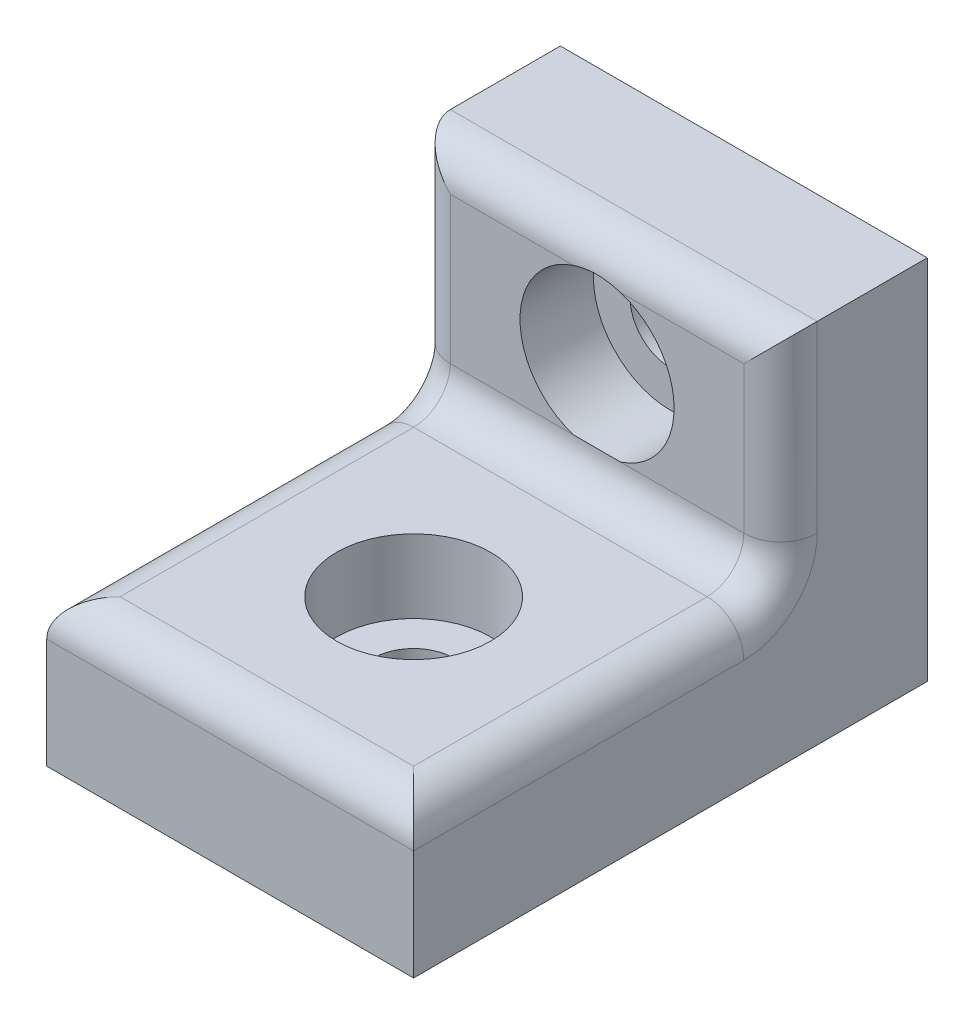
ISO-10303-21;
HEADER;
FILE_DESCRIPTION(('STEP AP214'),'2;1');
FILE_NAME('part.step','',(''),(''),'','','');
FILE_SCHEMA(('AUTOMOTIVE_DESIGN { 1 0 10303 214 1 1 1 1 }'));
ENDSEC;
DATA;
#1=APPLICATION_CONTEXT('core data for automotive mechanical design processes');
#2=APPLICATION_PROTOCOL_DEFINITION('international standard','automotive_design',2000,#1);
#3=PRODUCT_CONTEXT('',#1,'mechanical');
#4=PRODUCT('Part','Part','',(#3));
#5=PRODUCT_RELATED_PRODUCT_CATEGORY('part','',(#4));
#6=PRODUCT_DEFINITION_FORMATION('','',#4);
#7=PRODUCT_DEFINITION_CONTEXT('part definition',#1,'design');
#8=PRODUCT_DEFINITION('design','',#6,#7);
#9=PRODUCT_DEFINITION_SHAPE('','',#8);
#10=(LENGTH_UNIT() NAMED_UNIT(*) SI_UNIT(.MILLI.,.METRE.));
#11=(NAMED_UNIT(*) PLANE_ANGLE_UNIT() SI_UNIT($,.RADIAN.));
#12=(NAMED_UNIT(*) SI_UNIT($,.STERADIAN.) SOLID_ANGLE_UNIT());
#13=UNCERTAINTY_MEASURE_WITH_UNIT(LENGTH_MEASURE(1.E-05),#10,'distance_accuracy_value','');
#14=(GEOMETRIC_REPRESENTATION_CONTEXT(3) GLOBAL_UNCERTAINTY_ASSIGNED_CONTEXT((#13)) GLOBAL_UNIT_ASSIGNED_CONTEXT((#10,
#11,#12)) REPRESENTATION_CONTEXT('',''));
#15=CARTESIAN_POINT('',(0.,0.,0.));
#16=DIRECTION('',(0.,0.,1.));
#17=DIRECTION('',(1.,0.,0.));
#18=AXIS2_PLACEMENT_3D('',#15,#16,#17);
#19=CARTESIAN_POINT('',(0.,0.,9.));
#20=DIRECTION('',(0.,1.,0.));
#21=DIRECTION('',(0.,0.,1.));
#22=AXIS2_PLACEMENT_3D('',#19,#20,#21);
#23=CYLINDRICAL_SURFACE('',#22,1.1);
#24=CARTESIAN_POINT('',(0.,0.,9.));
#25=DIRECTION('',(0.,1.,0.));
#26=DIRECTION('',(0.,0.,1.));
#27=AXIS2_PLACEMENT_3D('',#24,#25,#26);
#28=CIRCLE('',#27,1.1);
#29=CARTESIAN_POINT('',(0.,0.,10.1));
#30=VERTEX_POINT('',#29);
#31=EDGE_CURVE('E203',#30,#30,#28,.T.);
#32=ORIENTED_EDGE('',*,*,#31,.F.);
#33=EDGE_LOOP('',(#32));
#34=FACE_BOUND('',#33,.T.);
#35=CARTESIAN_POINT('',(0.,2.,9.));
#36=DIRECTION('',(0.,1.,0.));
#37=DIRECTION('',(0.,0.,1.));
#38=AXIS2_PLACEMENT_3D('',#35,#36,#37);
#39=CIRCLE('',#38,1.1);
#40=CARTESIAN_POINT('',(0.,2.,10.1));
#41=VERTEX_POINT('',#40);
#42=EDGE_CURVE('E43',#41,#41,#39,.F.);
#43=ORIENTED_EDGE('',*,*,#42,.F.);
#44=EDGE_LOOP('',(#43));
#45=FACE_BOUND('',#44,.T.);
#46=ADVANCED_FACE('F39',(#34,#45),#23,.F.);
#47=CARTESIAN_POINT('',(0.,0.,4.));
#48=DIRECTION('',(0.,0.,1.));
#49=DIRECTION('',(1.,0.,0.));
#50=AXIS2_PLACEMENT_3D('',#47,#48,#49);
#51=PLANE('',#50);
#52=CARTESIAN_POINT('',(0.,7.,4.));
#53=DIRECTION('',(0.,0.,1.));
#54=DIRECTION('',(1.,0.,0.));
#55=AXIS2_PLACEMENT_3D('',#52,#53,#54);
#56=CIRCLE('',#55,2.1);
#57=CARTESIAN_POINT('',(-0.640312423743282,9.,4.));
#58=VERTEX_POINT('',#57);
#59=CARTESIAN_POINT('',(-0.640312423743286,5.,4.));
#60=VERTEX_POINT('',#59);
#61=EDGE_CURVE('E138',#58,#60,#56,.T.);
#62=ORIENTED_EDGE('',*,*,#61,.F.);
#63=DIRECTION('',(-1.,0.,0.));
#64=VECTOR('',#63,1.);
#65=CARTESIAN_POINT('',(-5.,9.,4.));
#66=LINE('',#65,#64);
#67=CARTESIAN_POINT('',(-4.,9.,4.));
#68=VERTEX_POINT('',#67);
#69=EDGE_CURVE('E150',#58,#68,#66,.T.);
#70=ORIENTED_EDGE('',*,*,#69,.T.);
#71=DIRECTION('',(0.,-1.,0.));
#72=VECTOR('',#71,1.);
#73=CARTESIAN_POINT('',(-4.,4.,4.));
#74=LINE('',#73,#72);
#75=CARTESIAN_POINT('',(-4.,5.,4.));
#76=VERTEX_POINT('',#75);
#77=EDGE_CURVE('E167',#68,#76,#74,.T.);
#78=ORIENTED_EDGE('',*,*,#77,.T.);
#79=DIRECTION('',(-1.,0.,0.));
#80=VECTOR('',#79,1.);
#81=CARTESIAN_POINT('',(0.,5.,4.));
#82=LINE('',#81,#80);
#83=EDGE_CURVE('E153',#76,#60,#82,.F.);
#84=ORIENTED_EDGE('',*,*,#83,.T.);
#85=EDGE_LOOP('',(#62,#70,#78,#84));
#86=FACE_BOUND('',#85,.T.);
#87=ADVANCED_FACE('F149',(#86),#51,.T.);
#88=CARTESIAN_POINT('',(0.,7.,0.));
#89=DIRECTION('',(0.,0.,1.));
#90=DIRECTION('',(1.,0.,0.));
#91=AXIS2_PLACEMENT_3D('',#88,#89,#90);
#92=CYLINDRICAL_SURFACE('',#91,1.1);
#93=CARTESIAN_POINT('',(0.,7.,0.));
#94=DIRECTION('',(0.,0.,1.));
#95=DIRECTION('',(1.,0.,0.));
#96=AXIS2_PLACEMENT_3D('',#93,#94,#95);
#97=CIRCLE('',#96,1.1);
#98=CARTESIAN_POINT('',(1.1,7.,0.));
#99=VERTEX_POINT('',#98);
#100=EDGE_CURVE('E226',#99,#99,#97,.T.);
#101=ORIENTED_EDGE('',*,*,#100,.F.);
#102=EDGE_LOOP('',(#101));
#103=FACE_BOUND('',#102,.T.);
#104=CARTESIAN_POINT('',(0.,7.,2.));
#105=DIRECTION('',(0.,0.,1.));
#106=DIRECTION('',(1.,0.,0.));
#107=AXIS2_PLACEMENT_3D('',#104,#105,#106);
#108=CIRCLE('',#107,1.1);
#109=CARTESIAN_POINT('',(1.1,7.,2.));
#110=VERTEX_POINT('',#109);
#111=EDGE_CURVE('E227',#110,#110,#108,.F.);
#112=ORIENTED_EDGE('',*,*,#111,.F.);
#113=EDGE_LOOP('',(#112));
#114=FACE_BOUND('',#113,.T.);
#115=ADVANCED_FACE('F276',(#103,#114),#92,.F.);
#116=CARTESIAN_POINT('',(-5.,10.,4.));
#117=DIRECTION('',(1.,0.,0.));
#118=DIRECTION('',(0.,1.,0.));
#119=AXIS2_PLACEMENT_3D('',#116,#117,#118);
#120=PLANE('',#119);
#121=CARTESIAN_POINT('',(-5.,5.,5.));
#122=DIRECTION('',(1.,0.,0.));
#123=DIRECTION('',(0.,1.,0.));
#124=AXIS2_PLACEMENT_3D('',#121,#122,#123);
#125=CIRCLE('',#124,2.);
#126=CARTESIAN_POINT('',(-5.,5.,3.));
#127=VERTEX_POINT('',#126);
#128=CARTESIAN_POINT('',(-5.,3.,5.));
#129=VERTEX_POINT('',#128);
#130=EDGE_CURVE('E182',#127,#129,#125,.F.);
#131=ORIENTED_EDGE('',*,*,#130,.F.);
#132=DIRECTION('',(0.,-1.,0.));
#133=VECTOR('',#132,1.);
#134=CARTESIAN_POINT('',(-5.,10.,3.));
#135=LINE('',#134,#133);
#136=CARTESIAN_POINT('',(-5.,10.,3.));
#137=VERTEX_POINT('',#136);
#138=EDGE_CURVE('E187',#127,#137,#135,.F.);
#139=ORIENTED_EDGE('',*,*,#138,.T.);
#140=DIRECTION('',(0.,0.,-1.));
#141=VECTOR('',#140,1.);
#142=CARTESIAN_POINT('',(-5.,10.,4.));
#143=LINE('',#142,#141);
#144=CARTESIAN_POINT('',(-5.,10.,0.));
#145=VERTEX_POINT('',#144);
#146=EDGE_CURVE('E329',#137,#145,#143,.T.);
#147=ORIENTED_EDGE('',*,*,#146,.T.);
#148=DIRECTION('',(0.,-1.,0.));
#149=VECTOR('',#148,1.);
#150=CARTESIAN_POINT('',(-5.,10.,0.));
#151=LINE('',#150,#149);
#152=CARTESIAN_POINT('',(-5.,0.,0.));
#153=VERTEX_POINT('',#152);
#154=EDGE_CURVE('E364',#145,#153,#151,.T.);
#155=ORIENTED_EDGE('',*,*,#154,.T.);
#156=DIRECTION('',(0.,0.,-1.));
#157=VECTOR('',#156,1.);
#158=CARTESIAN_POINT('',(-5.,0.,4.));
#159=LINE('',#158,#157);
#160=CARTESIAN_POINT('',(-5.,0.,14.));
#161=VERTEX_POINT('',#160);
#162=EDGE_CURVE('E353',#161,#153,#159,.T.);
#163=ORIENTED_EDGE('',*,*,#162,.F.);
#164=DIRECTION('',(0.,-1.,0.));
#165=VECTOR('',#164,1.);
#166=CARTESIAN_POINT('',(-5.,0.,14.));
#167=LINE('',#166,#165);
#168=CARTESIAN_POINT('',(-5.,3.,14.));
#169=VERTEX_POINT('',#168);
#170=EDGE_CURVE('E372',#169,#161,#167,.T.);
#171=ORIENTED_EDGE('',*,*,#170,.F.);
#172=DIRECTION('',(0.,0.,-1.));
#173=VECTOR('',#172,1.);
#174=CARTESIAN_POINT('',(-5.,3.,4.));
#175=LINE('',#174,#173);
#176=EDGE_CURVE('E185',#169,#129,#175,.T.);
#177=ORIENTED_EDGE('',*,*,#176,.T.);
#178=EDGE_LOOP('',(#131,#139,#147,#155,#163,#171,#177));
#179=FACE_BOUND('',#178,.T.);
#180=ADVANCED_FACE('F287',(#179),#120,.F.);
#181=CARTESIAN_POINT('',(-5.,0.,4.));
#182=DIRECTION('',(0.,1.,0.));
#183=DIRECTION('',(0.,0.,1.));
#184=AXIS2_PLACEMENT_3D('',#181,#182,#183);
#185=PLANE('',#184);
#186=ORIENTED_EDGE('',*,*,#31,.T.);
#187=EDGE_LOOP('',(#186));
#188=FACE_BOUND('',#187,.T.);
#189=DIRECTION('',(1.,0.,0.));
#190=VECTOR('',#189,1.);
#191=CARTESIAN_POINT('',(-5.,0.,0.));
#192=LINE('',#191,#190);
#193=CARTESIAN_POINT('',(5.,0.,0.));
#194=VERTEX_POINT('',#193);
#195=EDGE_CURVE('E362',#153,#194,#192,.T.);
#196=ORIENTED_EDGE('',*,*,#195,.T.);
#197=DIRECTION('',(0.,0.,-1.));
#198=VECTOR('',#197,1.);
#199=CARTESIAN_POINT('',(5.,0.,4.));
#200=LINE('',#199,#198);
#201=CARTESIAN_POINT('',(5.,0.,14.));
#202=VERTEX_POINT('',#201);
#203=EDGE_CURVE('E335',#202,#194,#200,.T.);
#204=ORIENTED_EDGE('',*,*,#203,.F.);
#205=DIRECTION('',(1.,0.,0.));
#206=VECTOR('',#205,1.);
#207=CARTESIAN_POINT('',(-5.,0.,14.));
#208=LINE('',#207,#206);
#209=EDGE_CURVE('E369',#161,#202,#208,.T.);
#210=ORIENTED_EDGE('',*,*,#209,.F.);
#211=ORIENTED_EDGE('',*,*,#162,.T.);
#212=EDGE_LOOP('',(#196,#204,#210,#211));
#213=FACE_BOUND('',#212,.T.);
#214=ADVANCED_FACE('F309',(#188,#213),#185,.F.);
#215=CARTESIAN_POINT('',(5.,10.,4.));
#216=DIRECTION('',(-1.,0.,0.));
#217=DIRECTION('',(0.,-1.,0.));
#218=AXIS2_PLACEMENT_3D('',#215,#216,#217);
#219=PLANE('',#218);
#220=DIRECTION('',(0.,0.,-1.));
#221=VECTOR('',#220,1.);
#222=CARTESIAN_POINT('',(5.,10.,4.));
#223=LINE('',#222,#221);
#224=CARTESIAN_POINT('',(5.,10.,3.));
#225=VERTEX_POINT('',#224);
#226=CARTESIAN_POINT('',(5.,10.,0.));
#227=VERTEX_POINT('',#226);
#228=EDGE_CURVE('E327',#225,#227,#223,.T.);
#229=ORIENTED_EDGE('',*,*,#228,.F.);
#230=DIRECTION('',(0.,1.,0.));
#231=VECTOR('',#230,1.);
#232=CARTESIAN_POINT('',(5.,4.,3.));
#233=LINE('',#232,#231);
#234=CARTESIAN_POINT('',(5.,5.,3.));
#235=VERTEX_POINT('',#234);
#236=EDGE_CURVE('E179',#225,#235,#233,.F.);
#237=ORIENTED_EDGE('',*,*,#236,.T.);
#238=CARTESIAN_POINT('',(5.,5.,5.));
#239=DIRECTION('',(-1.,0.,0.));
#240=DIRECTION('',(0.,-1.,0.));
#241=AXIS2_PLACEMENT_3D('',#238,#239,#240);
#242=CIRCLE('',#241,2.);
#243=CARTESIAN_POINT('',(5.,3.,5.));
#244=VERTEX_POINT('',#243);
#245=EDGE_CURVE('E176',#244,#235,#242,.F.);
#246=ORIENTED_EDGE('',*,*,#245,.F.);
#247=DIRECTION('',(0.,0.,-1.));
#248=VECTOR('',#247,1.);
#249=CARTESIAN_POINT('',(5.,3.,4.));
#250=LINE('',#249,#248);
#251=CARTESIAN_POINT('',(5.,3.,14.));
#252=VERTEX_POINT('',#251);
#253=EDGE_CURVE('E164',#244,#252,#250,.F.);
#254=ORIENTED_EDGE('',*,*,#253,.T.);
#255=DIRECTION('',(0.,1.,0.));
#256=VECTOR('',#255,1.);
#257=CARTESIAN_POINT('',(5.,0.,14.));
#258=LINE('',#257,#256);
#259=EDGE_CURVE('E367',#202,#252,#258,.T.);
#260=ORIENTED_EDGE('',*,*,#259,.F.);
#261=ORIENTED_EDGE('',*,*,#203,.T.);
#262=DIRECTION('',(0.,1.,0.));
#263=VECTOR('',#262,1.);
#264=CARTESIAN_POINT('',(5.,10.,0.));
#265=LINE('',#264,#263);
#266=EDGE_CURVE('E333',#194,#227,#265,.T.);
#267=ORIENTED_EDGE('',*,*,#266,.T.);
#268=EDGE_LOOP('',(#229,#237,#246,#254,#260,#261,#267));
#269=FACE_BOUND('',#268,.T.);
#270=ADVANCED_FACE('F305',(#269),#219,.F.);
#271=CARTESIAN_POINT('',(-5.,10.,4.));
#272=DIRECTION('',(0.,-1.,0.));
#273=DIRECTION('',(0.,0.,-1.));
#274=AXIS2_PLACEMENT_3D('',#271,#272,#273);
#275=PLANE('',#274);
#276=ORIENTED_EDGE('',*,*,#146,.F.);
#277=DIRECTION('',(-1.,0.,0.));
#278=VECTOR('',#277,1.);
#279=CARTESIAN_POINT('',(5.,10.,3.));
#280=LINE('',#279,#278);
#281=EDGE_CURVE('E48',#137,#225,#280,.F.);
#282=ORIENTED_EDGE('',*,*,#281,.T.);
#283=ORIENTED_EDGE('',*,*,#228,.T.);
#284=DIRECTION('',(-1.,0.,0.));
#285=VECTOR('',#284,1.);
#286=CARTESIAN_POINT('',(-5.,10.,0.));
#287=LINE('',#286,#285);
#288=EDGE_CURVE('E359',#227,#145,#287,.T.);
#289=ORIENTED_EDGE('',*,*,#288,.T.);
#290=EDGE_LOOP('',(#276,#282,#283,#289));
#291=FACE_BOUND('',#290,.T.);
#292=ADVANCED_FACE('F298',(#291),#275,.F.);
#293=CARTESIAN_POINT('',(0.640312423743286,5.,4.));
#294=VERTEX_POINT('',#293);
#295=CARTESIAN_POINT('',(0.640312423743282,9.,4.));
#296=VERTEX_POINT('',#295);
#297=EDGE_CURVE('E54',#294,#296,#56,.T.);
#298=ORIENTED_EDGE('',*,*,#297,.F.);
#299=CARTESIAN_POINT('',(4.,5.,4.));
#300=VERTEX_POINT('',#299);
#301=EDGE_CURVE('E351',#294,#300,#82,.F.);
#302=ORIENTED_EDGE('',*,*,#301,.T.);
#303=DIRECTION('',(0.,1.,0.));
#304=VECTOR('',#303,1.);
#305=CARTESIAN_POINT('',(4.,10.,4.));
#306=LINE('',#305,#304);
#307=CARTESIAN_POINT('',(4.,9.,4.));
#308=VERTEX_POINT('',#307);
#309=EDGE_CURVE('E163',#300,#308,#306,.T.);
#310=ORIENTED_EDGE('',*,*,#309,.T.);
#311=EDGE_CURVE('E162',#308,#296,#66,.T.);
#312=ORIENTED_EDGE('',*,*,#311,.T.);
#313=EDGE_LOOP('',(#298,#302,#310,#312));
#314=FACE_BOUND('',#313,.T.);
#315=ADVANCED_FACE('F278',(#314),#51,.T.);
#316=CARTESIAN_POINT('',(0.,0.,0.));
#317=DIRECTION('',(0.,0.,1.));
#318=DIRECTION('',(1.,0.,0.));
#319=AXIS2_PLACEMENT_3D('',#316,#317,#318);
#320=PLANE('',#319);
#321=ORIENTED_EDGE('',*,*,#100,.T.);
#322=EDGE_LOOP('',(#321));
#323=FACE_BOUND('',#322,.T.);
#324=ORIENTED_EDGE('',*,*,#154,.F.);
#325=ORIENTED_EDGE('',*,*,#288,.F.);
#326=ORIENTED_EDGE('',*,*,#266,.F.);
#327=ORIENTED_EDGE('',*,*,#195,.F.);
#328=EDGE_LOOP('',(#324,#325,#326,#327));
#329=FACE_BOUND('',#328,.T.);
#330=ADVANCED_FACE('F294',(#323,#329),#320,.F.);
#331=CARTESIAN_POINT('',(-5.,4.,14.));
#332=DIRECTION('',(0.,-1.,0.));
#333=DIRECTION('',(0.,0.,-1.));
#334=AXIS2_PLACEMENT_3D('',#331,#332,#333);
#335=PLANE('',#334);
#336=CARTESIAN_POINT('',(0.,4.,9.));
#337=DIRECTION('',(0.,1.,0.));
#338=DIRECTION('',(0.,0.,1.));
#339=AXIS2_PLACEMENT_3D('',#336,#337,#338);
#340=CIRCLE('',#339,2.1);
#341=CARTESIAN_POINT('',(0.,4.,11.1));
#342=VERTEX_POINT('',#341);
#343=EDGE_CURVE('E414',#342,#342,#340,.T.);
#344=ORIENTED_EDGE('',*,*,#343,.F.);
#345=EDGE_LOOP('',(#344));
#346=FACE_BOUND('',#345,.T.);
#347=DIRECTION('',(0.,0.,-1.));
#348=VECTOR('',#347,1.);
#349=CARTESIAN_POINT('',(-4.,4.,14.));
#350=LINE('',#349,#348);
#351=CARTESIAN_POINT('',(-4.,4.,5.));
#352=VERTEX_POINT('',#351);
#353=CARTESIAN_POINT('',(-4.,4.,13.));
#354=VERTEX_POINT('',#353);
#355=EDGE_CURVE('E193',#352,#354,#350,.F.);
#356=ORIENTED_EDGE('',*,*,#355,.T.);
#357=DIRECTION('',(-1.,0.,0.));
#358=VECTOR('',#357,1.);
#359=CARTESIAN_POINT('',(-5.,4.,13.));
#360=LINE('',#359,#358);
#361=CARTESIAN_POINT('',(4.,4.,13.));
#362=VERTEX_POINT('',#361);
#363=EDGE_CURVE('E196',#354,#362,#360,.F.);
#364=ORIENTED_EDGE('',*,*,#363,.T.);
#365=DIRECTION('',(0.,0.,-1.));
#366=VECTOR('',#365,1.);
#367=CARTESIAN_POINT('',(4.,4.,14.));
#368=LINE('',#367,#366);
#369=CARTESIAN_POINT('',(4.,4.,5.));
#370=VERTEX_POINT('',#369);
#371=EDGE_CURVE('E62',#362,#370,#368,.T.);
#372=ORIENTED_EDGE('',*,*,#371,.T.);
#373=DIRECTION('',(-1.,0.,0.));
#374=VECTOR('',#373,1.);
#375=CARTESIAN_POINT('',(-5.,4.,5.));
#376=LINE('',#375,#374);
#377=EDGE_CURVE('E191',#370,#352,#376,.T.);
#378=ORIENTED_EDGE('',*,*,#377,.T.);
#379=EDGE_LOOP('',(#356,#364,#372,#378));
#380=FACE_BOUND('',#379,.T.);
#381=ADVANCED_FACE('F291',(#346,#380),#335,.F.);
#382=CARTESIAN_POINT('',(0.,0.,14.));
#383=DIRECTION('',(0.,0.,-1.));
#384=DIRECTION('',(-1.,0.,0.));
#385=AXIS2_PLACEMENT_3D('',#382,#383,#384);
#386=PLANE('',#385);
#387=ORIENTED_EDGE('',*,*,#259,.T.);
#388=DIRECTION('',(-1.,0.,0.));
#389=VECTOR('',#388,1.);
#390=CARTESIAN_POINT('',(0.,3.,14.));
#391=LINE('',#390,#389);
#392=EDGE_CURVE('E189',#252,#169,#391,.T.);
#393=ORIENTED_EDGE('',*,*,#392,.T.);
#394=ORIENTED_EDGE('',*,*,#170,.T.);
#395=ORIENTED_EDGE('',*,*,#209,.T.);
#396=EDGE_LOOP('',(#387,#393,#394,#395));
#397=FACE_BOUND('',#396,.T.);
#398=ADVANCED_FACE('F268',(#397),#386,.F.);
#399=CARTESIAN_POINT('',(-4.,3.,4.));
#400=DIRECTION('',(0.,0.,-1.));
#401=DIRECTION('',(-1.,0.,0.));
#402=AXIS2_PLACEMENT_3D('',#399,#400,#401);
#403=CYLINDRICAL_SURFACE('',#402,1.);
#404=CARTESIAN_POINT('',(-4.,3.,5.));
#405=DIRECTION('',(0.,0.,-1.));
#406=DIRECTION('',(-1.,0.,0.));
#407=AXIS2_PLACEMENT_3D('',#404,#405,#406);
#408=CIRCLE('',#407,1.);
#409=EDGE_CURVE('E220',#129,#352,#408,.T.);
#410=ORIENTED_EDGE('',*,*,#409,.F.);
#411=ORIENTED_EDGE('',*,*,#176,.F.);
#412=CARTESIAN_POINT('',(-4.,3.,13.));
#413=DIRECTION('',(-0.707106781186547,0.,-0.707106781186547));
#414=DIRECTION('',(0.707106781186547,0.,-0.707106781186547));
#415=AXIS2_PLACEMENT_3D('',#412,#413,#414);
#416=ELLIPSE('',#415,1.41421356237309,1.);
#417=EDGE_CURVE('E223',#354,#169,#416,.F.);
#418=ORIENTED_EDGE('',*,*,#417,.F.);
#419=ORIENTED_EDGE('',*,*,#355,.F.);
#420=EDGE_LOOP('',(#410,#411,#418,#419));
#421=FACE_BOUND('',#420,.T.);
#422=ADVANCED_FACE('F41',(#421),#403,.T.);
#423=CARTESIAN_POINT('',(0.,3.,13.));
#424=DIRECTION('',(-1.,0.,0.));
#425=DIRECTION('',(0.,0.,1.));
#426=AXIS2_PLACEMENT_3D('',#423,#424,#425);
#427=CYLINDRICAL_SURFACE('',#426,1.);
#428=ORIENTED_EDGE('',*,*,#417,.T.);
#429=ORIENTED_EDGE('',*,*,#392,.F.);
#430=CARTESIAN_POINT('',(4.,3.,13.));
#431=DIRECTION('',(0.707106781186547,0.,-0.707106781186547));
#432=DIRECTION('',(-0.707106781186547,0.,-0.707106781186547));
#433=AXIS2_PLACEMENT_3D('',#430,#431,#432);
#434=ELLIPSE('',#433,1.41421356237309,1.);
#435=EDGE_CURVE('E218',#362,#252,#434,.T.);
#436=ORIENTED_EDGE('',*,*,#435,.F.);
#437=ORIENTED_EDGE('',*,*,#363,.F.);
#438=EDGE_LOOP('',(#428,#429,#436,#437));
#439=FACE_BOUND('',#438,.T.);
#440=ADVANCED_FACE('F261',(#439),#427,.T.);
#441=CARTESIAN_POINT('',(-4.,5.,5.));
#442=DIRECTION('',(1.,0.,0.));
#443=DIRECTION('',(0.,1.,0.));
#444=AXIS2_PLACEMENT_3D('',#441,#442,#443);
#445=TOROIDAL_SURFACE('',#444,2.,1.);
#446=ORIENTED_EDGE('',*,*,#130,.T.);
#447=ORIENTED_EDGE('',*,*,#409,.T.);
#448=CARTESIAN_POINT('',(-4.,5.,5.));
#449=DIRECTION('',(1.,0.,0.));
#450=DIRECTION('',(0.,1.,0.));
#451=AXIS2_PLACEMENT_3D('',#448,#449,#450);
#452=CIRCLE('',#451,1.);
#453=EDGE_CURVE('E215',#76,#352,#452,.F.);
#454=ORIENTED_EDGE('',*,*,#453,.F.);
#455=CARTESIAN_POINT('',(-4.,5.,3.));
#456=DIRECTION('',(0.,-1.,0.));
#457=DIRECTION('',(0.,0.,-1.));
#458=AXIS2_PLACEMENT_3D('',#455,#456,#457);
#459=CIRCLE('',#458,1.);
#460=EDGE_CURVE('E212',#127,#76,#459,.F.);
#461=ORIENTED_EDGE('',*,*,#460,.F.);
#462=EDGE_LOOP('',(#446,#447,#454,#461));
#463=FACE_BOUND('',#462,.T.);
#464=ADVANCED_FACE('F259',(#463),#445,.T.);
#465=CARTESIAN_POINT('',(4.,3.,14.));
#466=DIRECTION('',(0.,0.,-1.));
#467=DIRECTION('',(-1.,0.,0.));
#468=AXIS2_PLACEMENT_3D('',#465,#466,#467);
#469=CYLINDRICAL_SURFACE('',#468,1.);
#470=ORIENTED_EDGE('',*,*,#435,.T.);
#471=ORIENTED_EDGE('',*,*,#253,.F.);
#472=CARTESIAN_POINT('',(4.,3.,5.));
#473=DIRECTION('',(0.,0.,-1.));
#474=DIRECTION('',(-1.,0.,0.));
#475=AXIS2_PLACEMENT_3D('',#472,#473,#474);
#476=CIRCLE('',#475,1.);
#477=EDGE_CURVE('E209',#370,#244,#476,.T.);
#478=ORIENTED_EDGE('',*,*,#477,.F.);
#479=ORIENTED_EDGE('',*,*,#371,.F.);
#480=EDGE_LOOP('',(#470,#471,#478,#479));
#481=FACE_BOUND('',#480,.T.);
#482=ADVANCED_FACE('F255',(#481),#469,.T.);
#483=CARTESIAN_POINT('',(-5.,5.,5.));
#484=DIRECTION('',(-1.,0.,0.));
#485=DIRECTION('',(0.,0.,1.));
#486=AXIS2_PLACEMENT_3D('',#483,#484,#485);
#487=CYLINDRICAL_SURFACE('',#486,1.);
#488=ORIENTED_EDGE('',*,*,#453,.T.);
#489=ORIENTED_EDGE('',*,*,#377,.F.);
#490=CARTESIAN_POINT('',(4.,5.,5.));
#491=DIRECTION('',(-1.,0.,0.));
#492=DIRECTION('',(0.,-1.,0.));
#493=AXIS2_PLACEMENT_3D('',#490,#491,#492);
#494=CIRCLE('',#493,1.);
#495=EDGE_CURVE('E206',#300,#370,#494,.T.);
#496=ORIENTED_EDGE('',*,*,#495,.F.);
#497=ORIENTED_EDGE('',*,*,#301,.F.);
#498=DIRECTION('',(-1.,0.,0.));
#499=VECTOR('',#498,1.);
#500=CARTESIAN_POINT('',(-5.,5.,4.));
#501=LINE('',#500,#499);
#502=EDGE_CURVE('E229',#60,#294,#501,.F.);
#503=ORIENTED_EDGE('',*,*,#502,.F.);
#504=ORIENTED_EDGE('',*,*,#83,.F.);
#505=EDGE_LOOP('',(#488,#489,#496,#497,#503,#504));
#506=FACE_BOUND('',#505,.T.);
#507=ADVANCED_FACE('F251',(#506),#487,.F.);
#508=CARTESIAN_POINT('',(-4.,0.,3.));
#509=DIRECTION('',(0.,1.,0.));
#510=DIRECTION('',(-1.,0.,0.));
#511=AXIS2_PLACEMENT_3D('',#508,#509,#510);
#512=CYLINDRICAL_SURFACE('',#511,1.);
#513=ORIENTED_EDGE('',*,*,#460,.T.);
#514=ORIENTED_EDGE('',*,*,#77,.F.);
#515=CARTESIAN_POINT('',(-4.,9.,3.));
#516=DIRECTION('',(0.707106781186547,0.707106781186548,0.));
#517=DIRECTION('',(0.707106781186548,-0.707106781186547,0.));
#518=AXIS2_PLACEMENT_3D('',#515,#516,#517);
#519=ELLIPSE('',#518,1.4142135623731,1.);
#520=EDGE_CURVE('E161',#137,#68,#519,.T.);
#521=ORIENTED_EDGE('',*,*,#520,.F.);
#522=ORIENTED_EDGE('',*,*,#138,.F.);
#523=EDGE_LOOP('',(#513,#514,#521,#522));
#524=FACE_BOUND('',#523,.T.);
#525=ADVANCED_FACE('F247',(#524),#512,.T.);
#526=CARTESIAN_POINT('',(4.,5.,5.));
#527=DIRECTION('',(-1.,0.,0.));
#528=DIRECTION('',(0.,-1.,0.));
#529=AXIS2_PLACEMENT_3D('',#526,#527,#528);
#530=TOROIDAL_SURFACE('',#529,2.,1.);
#531=ORIENTED_EDGE('',*,*,#477,.T.);
#532=ORIENTED_EDGE('',*,*,#245,.T.);
#533=CARTESIAN_POINT('',(4.,5.,3.));
#534=DIRECTION('',(0.,-1.,0.));
#535=DIRECTION('',(0.,0.,-1.));
#536=AXIS2_PLACEMENT_3D('',#533,#534,#535);
#537=CIRCLE('',#536,1.);
#538=EDGE_CURVE('E202',#300,#235,#537,.F.);
#539=ORIENTED_EDGE('',*,*,#538,.F.);
#540=ORIENTED_EDGE('',*,*,#495,.T.);
#541=EDGE_LOOP('',(#531,#532,#539,#540));
#542=FACE_BOUND('',#541,.T.);
#543=ADVANCED_FACE('F243',(#542),#530,.T.);
#544=CARTESIAN_POINT('',(0.,9.,3.));
#545=DIRECTION('',(1.,0.,0.));
#546=DIRECTION('',(0.,0.,-1.));
#547=AXIS2_PLACEMENT_3D('',#544,#545,#546);
#548=CYLINDRICAL_SURFACE('',#547,1.);
#549=CARTESIAN_POINT('',(0.640312423743283,9.,4.));
#550=CARTESIAN_POINT('',(0.605952557507985,9.01100146165522,4.00000143009947));
#551=CARTESIAN_POINT('',(0.571308757169568,9.02111576317917,3.99995430248211));
#552=CARTESIAN_POINT('',(0.501546279349888,9.03954699930204,3.99976722332236));
#553=CARTESIAN_POINT('',(0.466427598725952,9.04786392200004,3.99962727116539));
#554=CARTESIAN_POINT('',(0.395808341298404,9.06267730559244,3.9992588320904));
#555=CARTESIAN_POINT('',(0.360307759443885,9.06917374237886,3.99903034400004));
#556=CARTESIAN_POINT('',(0.289019160206037,9.08032918585438,3.99846338818369));
#557=CARTESIAN_POINT('',(0.253231137127545,9.08498815604509,3.99812491827333));
#558=CARTESIAN_POINT('',(0.181462281486185,9.09245623398739,3.99741949516708));
#559=CARTESIAN_POINT('',(0.145481443842409,9.09526529274741,3.99705254121713));
#560=CARTESIAN_POINT('',(0.0734240161841169,9.09902611338739,3.99598560171995));
#561=CARTESIAN_POINT('',(0.0373474230395412,9.0999778137862,3.9952856051495));
#562=CARTESIAN_POINT('',(-0.019443540167265,9.1000121335151,3.99481632297556));
#563=CARTESIAN_POINT('',(-0.0401565379020753,9.09971817720997,3.99477761658405));
#564=CARTESIAN_POINT('',(-0.0770341448878429,9.0986489894422,3.9948753673535));
#565=CARTESIAN_POINT('',(-0.093202442371098,9.0979931197317,3.9949753553568));
#566=CARTESIAN_POINT('',(-0.12939737788502,9.09610563809366,3.99522869474359));
#567=CARTESIAN_POINT('',(-0.149418795585397,9.09477363093555,3.9953890939304));
#568=CARTESIAN_POINT('',(-0.193285436096007,9.09122313077302,3.99577870744827));
#569=CARTESIAN_POINT('',(-0.217120786606221,9.08888296365938,3.9960152320292));
#570=CARTESIAN_POINT('',(-0.268555000370678,9.08294326665673,3.99656017835416));
#571=CARTESIAN_POINT('',(-0.296137437613968,9.07920106202486,3.99687403938895));
#572=CARTESIAN_POINT('',(-0.34881867038011,9.07098412551967,3.9974796369561));
#573=CARTESIAN_POINT('',(-0.373931256138461,9.06659746626534,3.9977710142982));
#574=CARTESIAN_POINT('',(-0.421077314912373,9.05747456440558,3.99829417681229));
#575=CARTESIAN_POINT('',(-0.443130054628687,9.05283789807784,3.99852895391583));
#576=CARTESIAN_POINT('',(-0.484191622509356,9.04351209267005,3.99894422384472));
#577=CARTESIAN_POINT('',(-0.503220144886501,9.03890968035945,3.99912779727627));
#578=CARTESIAN_POINT('',(-0.538277088717363,9.02990983608622,3.9994416296785));
#579=CARTESIAN_POINT('',(-0.554324528596982,9.02558644668377,3.99957575337599));
#580=CARTESIAN_POINT('',(-0.593768938945573,9.01445581223956,3.99985206117514));
#581=CARTESIAN_POINT('',(-0.617104628061132,9.00743021774688,3.9999688546818));
#582=CARTESIAN_POINT('',(-0.640312423743282,9.,4.));
#583=B_SPLINE_CURVE_WITH_KNOTS('',3,(#549,#550,#551,#552,#553,#554,#555,#556,#557,#558,#559,
#560,#561,#562,#563,#564,#565,#566,#567,#568,#569,#570,#571,#572,#573,#574,#575,#576,#577,#578,
#579,#580,#581,#582),.UNSPECIFIED.,.F.,.F.,(4,2,2,2,2,2,2,2,2,2,2,2,2,2,2,2,4),(0.,
0.108222270440233,0.21644525742661,0.324669677500513,0.432896247174867,0.541125682919898,
0.649358701148917,0.711494004409998,0.760035524695026,0.820226115765076,0.89206560518641,
0.975553609333234,1.05202032286343,1.11961702502069,1.1783434758553,1.2281995077995,
1.30129739216953),.UNSPECIFIED.);
#584=EDGE_CURVE('E12',#296,#58,#583,.T.);
#585=ORIENTED_EDGE('',*,*,#584,.F.);
#586=ORIENTED_EDGE('',*,*,#311,.F.);
#587=CARTESIAN_POINT('',(4.,9.,3.));
#588=DIRECTION('',(0.707106781186547,-0.707106781186547,0.));
#589=DIRECTION('',(0.707106781186547,0.707106781186548,0.));
#590=AXIS2_PLACEMENT_3D('',#587,#588,#589);
#591=ELLIPSE('',#590,1.41421356237309,1.);
#592=EDGE_CURVE('E200',#225,#308,#591,.T.);
#593=ORIENTED_EDGE('',*,*,#592,.F.);
#594=ORIENTED_EDGE('',*,*,#281,.F.);
#595=ORIENTED_EDGE('',*,*,#520,.T.);
#596=ORIENTED_EDGE('',*,*,#69,.F.);
#597=EDGE_LOOP('',(#585,#586,#593,#594,#595,#596));
#598=FACE_BOUND('',#597,.T.);
#599=ADVANCED_FACE('F158',(#598),#548,.T.);
#600=CARTESIAN_POINT('',(4.,0.,3.));
#601=DIRECTION('',(0.,-1.,0.));
#602=DIRECTION('',(1.,0.,0.));
#603=AXIS2_PLACEMENT_3D('',#600,#601,#602);
#604=CYLINDRICAL_SURFACE('',#603,1.);
#605=ORIENTED_EDGE('',*,*,#538,.T.);
#606=ORIENTED_EDGE('',*,*,#236,.F.);
#607=ORIENTED_EDGE('',*,*,#592,.T.);
#608=ORIENTED_EDGE('',*,*,#309,.F.);
#609=EDGE_LOOP('',(#605,#606,#607,#608));
#610=FACE_BOUND('',#609,.T.);
#611=ADVANCED_FACE('F242',(#610),#604,.T.);
#612=CARTESIAN_POINT('',(0.,7.,2.));
#613=DIRECTION('',(0.,0.,1.));
#614=DIRECTION('',(1.,0.,0.));
#615=AXIS2_PLACEMENT_3D('',#612,#613,#614);
#616=PLANE('',#615);
#617=CARTESIAN_POINT('',(0.,7.,2.));
#618=DIRECTION('',(0.,0.,1.));
#619=DIRECTION('',(1.,0.,0.));
#620=AXIS2_PLACEMENT_3D('',#617,#618,#619);
#621=CIRCLE('',#620,2.1);
#622=CARTESIAN_POINT('',(2.1,7.,2.));
#623=VERTEX_POINT('',#622);
#624=EDGE_CURVE('E154',#623,#623,#621,.T.);
#625=ORIENTED_EDGE('',*,*,#624,.T.);
#626=EDGE_LOOP('',(#625));
#627=FACE_BOUND('',#626,.T.);
#628=ORIENTED_EDGE('',*,*,#111,.T.);
#629=EDGE_LOOP('',(#628));
#630=FACE_BOUND('',#629,.T.);
#631=ADVANCED_FACE('F387',(#627,#630),#616,.T.);
#632=CARTESIAN_POINT('',(0.,7.,4.));
#633=DIRECTION('',(0.,0.,1.));
#634=DIRECTION('',(1.,0.,0.));
#635=AXIS2_PLACEMENT_3D('',#632,#633,#634);
#636=PLANE('',#635);
#637=ORIENTED_EDGE('',*,*,#502,.T.);
#638=EDGE_CURVE('E155',#60,#294,#56,.T.);
#639=ORIENTED_EDGE('',*,*,#638,.F.);
#640=EDGE_LOOP('',(#637,#639));
#641=FACE_BOUND('',#640,.T.);
#642=ADVANCED_FACE('F391',(#641),#636,.F.);
#643=CARTESIAN_POINT('',(0.,7.,2.));
#644=DIRECTION('',(0.,0.,1.));
#645=DIRECTION('',(1.,0.,0.));
#646=AXIS2_PLACEMENT_3D('',#643,#644,#645);
#647=CYLINDRICAL_SURFACE('',#646,2.1);
#648=ORIENTED_EDGE('',*,*,#584,.T.);
#649=ORIENTED_EDGE('',*,*,#61,.T.);
#650=ORIENTED_EDGE('',*,*,#638,.T.);
#651=ORIENTED_EDGE('',*,*,#297,.T.);
#652=EDGE_LOOP('',(#648,#649,#650,#651));
#653=FACE_BOUND('',#652,.T.);
#654=ORIENTED_EDGE('',*,*,#624,.F.);
#655=EDGE_LOOP('',(#654));
#656=FACE_BOUND('',#655,.T.);
#657=ADVANCED_FACE('F136',(#653,#656),#647,.F.);
#658=CARTESIAN_POINT('',(0.,2.,9.));
#659=DIRECTION('',(0.,1.,0.));
#660=DIRECTION('',(0.,0.,1.));
#661=AXIS2_PLACEMENT_3D('',#658,#659,#660);
#662=PLANE('',#661);
#663=CARTESIAN_POINT('',(0.,2.,9.));
#664=DIRECTION('',(0.,1.,0.));
#665=DIRECTION('',(0.,0.,1.));
#666=AXIS2_PLACEMENT_3D('',#663,#664,#665);
#667=CIRCLE('',#666,2.1);
#668=CARTESIAN_POINT('',(0.,2.,11.1));
#669=VERTEX_POINT('',#668);
#670=EDGE_CURVE('E411',#669,#669,#667,.T.);
#671=ORIENTED_EDGE('',*,*,#670,.T.);
#672=EDGE_LOOP('',(#671));
#673=FACE_BOUND('',#672,.T.);
#674=ORIENTED_EDGE('',*,*,#42,.T.);
#675=EDGE_LOOP('',(#674));
#676=FACE_BOUND('',#675,.T.);
#677=ADVANCED_FACE('F390',(#673,#676),#662,.T.);
#678=CARTESIAN_POINT('',(0.,2.,9.));
#679=DIRECTION('',(0.,1.,0.));
#680=DIRECTION('',(0.,0.,1.));
#681=AXIS2_PLACEMENT_3D('',#678,#679,#680);
#682=CYLINDRICAL_SURFACE('',#681,2.1);
#683=ORIENTED_EDGE('',*,*,#670,.F.);
#684=EDGE_LOOP('',(#683));
#685=FACE_BOUND('',#684,.T.);
#686=ORIENTED_EDGE('',*,*,#343,.T.);
#687=EDGE_LOOP('',(#686));
#688=FACE_BOUND('',#687,.T.);
#689=ADVANCED_FACE('F396',(#685,#688),#682,.F.);
#690=CLOSED_SHELL('',(#46,#87,#115,#180,#214,#270,#292,#315,#330,#381,#398,#422,#440,#464,#482,
#507,#525,#543,#599,#611,#631,#642,#657,#677,#689));
#691=MANIFOLD_SOLID_BREP('B2',#690);
#692=ADVANCED_BREP_SHAPE_REPRESENTATION('',(#18,#691),#14);
#693=SHAPE_DEFINITION_REPRESENTATION(#9,#692);
ENDSEC;
END-ISO-10303-21;
